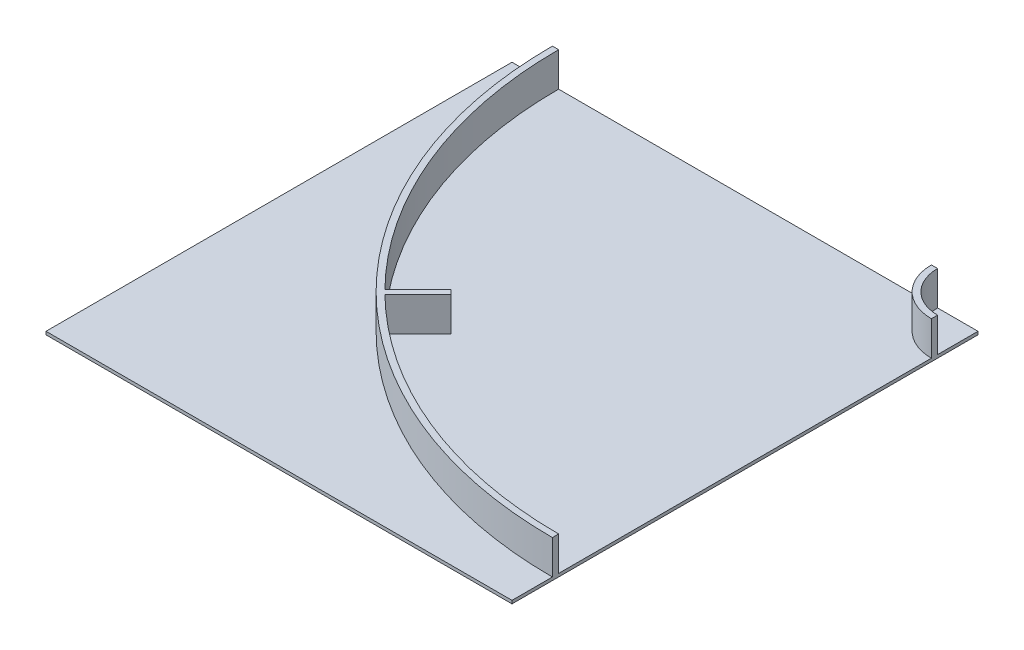
ISO-10303-21;
HEADER;
FILE_DESCRIPTION(('STEP AP214'),'2;1');
FILE_NAME('part.step','',(''),(''),'','','');
FILE_SCHEMA(('AUTOMOTIVE_DESIGN { 1 0 10303 214 1 1 1 1 }'));
ENDSEC;
DATA;
#1=APPLICATION_CONTEXT('core data for automotive mechanical design processes');
#2=APPLICATION_PROTOCOL_DEFINITION('international standard','automotive_design',2000,#1);
#3=PRODUCT_CONTEXT('',#1,'mechanical');
#4=PRODUCT('Part','Part','',(#3));
#5=PRODUCT_RELATED_PRODUCT_CATEGORY('part','',(#4));
#6=PRODUCT_DEFINITION_FORMATION('','',#4);
#7=PRODUCT_DEFINITION_CONTEXT('part definition',#1,'design');
#8=PRODUCT_DEFINITION('design','',#6,#7);
#9=PRODUCT_DEFINITION_SHAPE('','',#8);
#10=(LENGTH_UNIT() NAMED_UNIT(*) SI_UNIT(.MILLI.,.METRE.));
#11=(NAMED_UNIT(*) PLANE_ANGLE_UNIT() SI_UNIT($,.RADIAN.));
#12=(NAMED_UNIT(*) SI_UNIT($,.STERADIAN.) SOLID_ANGLE_UNIT());
#13=UNCERTAINTY_MEASURE_WITH_UNIT(LENGTH_MEASURE(1.E-05),#10,'distance_accuracy_value','');
#14=(GEOMETRIC_REPRESENTATION_CONTEXT(3) GLOBAL_UNCERTAINTY_ASSIGNED_CONTEXT((#13)) GLOBAL_UNIT_ASSIGNED_CONTEXT((#10,
#11,#12)) REPRESENTATION_CONTEXT('',''));
#15=CARTESIAN_POINT('',(0.,0.,0.));
#16=DIRECTION('',(0.,0.,1.));
#17=DIRECTION('',(1.,0.,0.));
#18=AXIS2_PLACEMENT_3D('',#15,#16,#17);
#19=CARTESIAN_POINT('',(0.,10.,0.));
#20=DIRECTION('',(0.,1.,0.));
#21=DIRECTION('',(0.,0.,1.));
#22=AXIS2_PLACEMENT_3D('',#19,#20,#21);
#23=PLANE('',#22);
#24=DIRECTION('',(-0.707106781186547,0.,-0.707106781186547));
#25=VECTOR('',#24,1.);
#26=CARTESIAN_POINT('',(-91.4570696119912,10.,105.599205235722));
#27=LINE('',#26,#25);
#28=CARTESIAN_POINT('',(-91.4570696119912,10.,105.599205235722));
#29=VERTEX_POINT('',#28);
#30=CARTESIAN_POINT('',(-105.599205235722,10.,91.4570696119911));
#31=VERTEX_POINT('',#30);
#32=EDGE_CURVE('E80',#29,#31,#27,.T.);
#33=ORIENTED_EDGE('',*,*,#32,.F.);
#34=DIRECTION('',(0.707106781186548,0.,-0.707106781186548));
#35=VECTOR('',#34,1.);
#36=CARTESIAN_POINT('',(-197.523086789973,10.,211.665222413704));
#37=LINE('',#36,#35);
#38=CARTESIAN_POINT('',(-197.496897290672,10.,211.639032914403));
#39=VERTEX_POINT('',#38);
#40=EDGE_CURVE('E202',#39,#29,#37,.T.);
#41=ORIENTED_EDGE('',*,*,#40,.F.);
#42=CARTESIAN_POINT('',(750.,10.,-750.));
#43=DIRECTION('',(0.,1.,0.));
#44=DIRECTION('',(0.,0.,1.));
#45=AXIS2_PLACEMENT_3D('',#42,#43,#44);
#46=CIRCLE('',#45,1350.);
#47=CARTESIAN_POINT('',(750.,10.,599.999999999999));
#48=VERTEX_POINT('',#47);
#49=EDGE_CURVE('E66',#39,#48,#46,.T.);
#50=ORIENTED_EDGE('',*,*,#49,.T.);
#51=DIRECTION('',(0.,0.,-1.));
#52=VECTOR('',#51,1.);
#53=CARTESIAN_POINT('',(750.,10.,-750.));
#54=LINE('',#53,#52);
#55=CARTESIAN_POINT('',(750.,10.,-600.));
#56=VERTEX_POINT('',#55);
#57=EDGE_CURVE('E291',#48,#56,#54,.T.);
#58=ORIENTED_EDGE('',*,*,#57,.T.);
#59=CARTESIAN_POINT('',(750.,10.,-750.));
#60=DIRECTION('',(0.,1.,0.));
#61=DIRECTION('',(0.,0.,1.));
#62=AXIS2_PLACEMENT_3D('',#59,#60,#61);
#63=CIRCLE('',#62,150.);
#64=CARTESIAN_POINT('',(600.,10.,-750.));
#65=VERTEX_POINT('',#64);
#66=EDGE_CURVE('E214',#65,#56,#63,.T.);
#67=ORIENTED_EDGE('',*,*,#66,.F.);
#68=DIRECTION('',(-1.,0.,0.));
#69=VECTOR('',#68,1.);
#70=CARTESIAN_POINT('',(-750.,10.,-750.));
#71=LINE('',#70,#69);
#72=CARTESIAN_POINT('',(-600.,10.,-750.));
#73=VERTEX_POINT('',#72);
#74=EDGE_CURVE('E280',#65,#73,#71,.T.);
#75=ORIENTED_EDGE('',*,*,#74,.T.);
#76=CARTESIAN_POINT('',(-211.639032914403,10.,197.496897290672));
#77=VERTEX_POINT('',#76);
#78=EDGE_CURVE('E240',#73,#77,#46,.T.);
#79=ORIENTED_EDGE('',*,*,#78,.T.);
#80=DIRECTION('',(-0.707106781186548,0.,0.707106781186548));
#81=VECTOR('',#80,1.);
#82=CARTESIAN_POINT('',(-211.665222413704,10.,197.523086789973));
#83=LINE('',#82,#81);
#84=EDGE_CURVE('E85',#31,#77,#83,.T.);
#85=ORIENTED_EDGE('',*,*,#84,.F.);
#86=EDGE_LOOP('',(#33,#41,#50,#58,#67,#75,#79,#85));
#87=FACE_BOUND('',#86,.T.);
#88=ADVANCED_FACE('F62',(#87),#23,.T.);
#89=CARTESIAN_POINT('',(750.,120.,-750.));
#90=DIRECTION('',(0.,-1.,0.));
#91=DIRECTION('',(0.,0.,-1.));
#92=AXIS2_PLACEMENT_3D('',#89,#90,#91);
#93=CYLINDRICAL_SURFACE('',#92,1350.);
#94=ORIENTED_EDGE('',*,*,#49,.F.);
#95=DIRECTION('',(0.,-1.,0.));
#96=VECTOR('',#95,1.);
#97=CARTESIAN_POINT('',(-197.496897290672,120.,211.639032914403));
#98=LINE('',#97,#96);
#99=CARTESIAN_POINT('',(-197.496897290672,120.,211.639032914403));
#100=VERTEX_POINT('',#99);
#101=EDGE_CURVE('E198',#39,#100,#98,.F.);
#102=ORIENTED_EDGE('',*,*,#101,.T.);
#103=CARTESIAN_POINT('',(750.,120.,-750.));
#104=DIRECTION('',(0.,1.,0.));
#105=DIRECTION('',(0.,0.,1.));
#106=AXIS2_PLACEMENT_3D('',#103,#104,#105);
#107=CIRCLE('',#106,1350.);
#108=CARTESIAN_POINT('',(750.,120.,599.999999999999));
#109=VERTEX_POINT('',#108);
#110=EDGE_CURVE('E245',#100,#109,#107,.T.);
#111=ORIENTED_EDGE('',*,*,#110,.T.);
#112=DIRECTION('',(0.,-1.,0.));
#113=VECTOR('',#112,1.);
#114=CARTESIAN_POINT('',(750.,120.,599.999999999999));
#115=LINE('',#114,#113);
#116=EDGE_CURVE('E263',#109,#48,#115,.T.);
#117=ORIENTED_EDGE('',*,*,#116,.T.);
#118=EDGE_LOOP('',(#94,#102,#111,#117));
#119=FACE_BOUND('',#118,.T.);
#120=ADVANCED_FACE('F362',(#119),#93,.F.);
#121=CARTESIAN_POINT('',(-600.,120.,-750.));
#122=VERTEX_POINT('',#121);
#123=CARTESIAN_POINT('',(-211.639032914403,120.,197.496897290672));
#124=VERTEX_POINT('',#123);
#125=EDGE_CURVE('E246',#122,#124,#107,.T.);
#126=ORIENTED_EDGE('',*,*,#125,.T.);
#127=DIRECTION('',(0.,-1.,0.));
#128=VECTOR('',#127,1.);
#129=CARTESIAN_POINT('',(-211.639032914403,120.,197.496897290672));
#130=LINE('',#129,#128);
#131=EDGE_CURVE('E190',#124,#77,#130,.T.);
#132=ORIENTED_EDGE('',*,*,#131,.T.);
#133=ORIENTED_EDGE('',*,*,#78,.F.);
#134=DIRECTION('',(0.,-1.,0.));
#135=VECTOR('',#134,1.);
#136=CARTESIAN_POINT('',(-600.,120.,-750.));
#137=LINE('',#136,#135);
#138=EDGE_CURVE('E248',#122,#73,#137,.T.);
#139=ORIENTED_EDGE('',*,*,#138,.F.);
#140=EDGE_LOOP('',(#126,#132,#133,#139));
#141=FACE_BOUND('',#140,.T.);
#142=ADVANCED_FACE('F365',(#141),#93,.F.);
#143=CARTESIAN_POINT('',(750.,10.,-750.));
#144=DIRECTION('',(0.,1.,0.));
#145=DIRECTION('',(0.,0.,1.));
#146=AXIS2_PLACEMENT_3D('',#143,#144,#145);
#147=CIRCLE('',#146,130.);
#148=CARTESIAN_POINT('',(620.,10.,-750.));
#149=VERTEX_POINT('',#148);
#150=CARTESIAN_POINT('',(750.,10.,-620.));
#151=VERTEX_POINT('',#150);
#152=EDGE_CURVE('E209',#149,#151,#147,.T.);
#153=ORIENTED_EDGE('',*,*,#152,.T.);
#154=CARTESIAN_POINT('',(750.,10.,-750.));
#155=VERTEX_POINT('',#154);
#156=EDGE_CURVE('E282',#151,#155,#54,.T.);
#157=ORIENTED_EDGE('',*,*,#156,.T.);
#158=EDGE_CURVE('E281',#155,#149,#71,.T.);
#159=ORIENTED_EDGE('',*,*,#158,.T.);
#160=EDGE_LOOP('',(#153,#157,#159));
#161=FACE_BOUND('',#160,.T.);
#162=ADVANCED_FACE('F345',(#161),#23,.T.);
#163=CARTESIAN_POINT('',(750.,10.,-750.));
#164=DIRECTION('',(-1.,0.,0.));
#165=DIRECTION('',(0.,0.,1.));
#166=AXIS2_PLACEMENT_3D('',#163,#164,#165);
#167=PLANE('',#166);
#168=DIRECTION('',(0.,0.,-1.));
#169=VECTOR('',#168,1.);
#170=CARTESIAN_POINT('',(750.,0.,-750.));
#171=LINE('',#170,#169);
#172=CARTESIAN_POINT('',(750.,0.,750.));
#173=VERTEX_POINT('',#172);
#174=CARTESIAN_POINT('',(750.,0.,-750.));
#175=VERTEX_POINT('',#174);
#176=EDGE_CURVE('E268',#173,#175,#171,.T.);
#177=ORIENTED_EDGE('',*,*,#176,.T.);
#178=DIRECTION('',(0.,-1.,0.));
#179=VECTOR('',#178,1.);
#180=CARTESIAN_POINT('',(750.,10.,-750.));
#181=LINE('',#180,#179);
#182=EDGE_CURVE('E12',#155,#175,#181,.T.);
#183=ORIENTED_EDGE('',*,*,#182,.F.);
#184=ORIENTED_EDGE('',*,*,#156,.F.);
#185=DIRECTION('',(0.,-1.,0.));
#186=VECTOR('',#185,1.);
#187=CARTESIAN_POINT('',(750.,120.,-620.));
#188=LINE('',#187,#186);
#189=CARTESIAN_POINT('',(750.,120.,-620.));
#190=VERTEX_POINT('',#189);
#191=EDGE_CURVE('E220',#190,#151,#188,.T.);
#192=ORIENTED_EDGE('',*,*,#191,.F.);
#193=DIRECTION('',(0.,0.,-1.));
#194=VECTOR('',#193,1.);
#195=CARTESIAN_POINT('',(750.,120.,-1.11022302462516E-13));
#196=LINE('',#195,#194);
#197=CARTESIAN_POINT('',(750.,120.,-600.));
#198=VERTEX_POINT('',#197);
#199=EDGE_CURVE('E218',#198,#190,#196,.T.);
#200=ORIENTED_EDGE('',*,*,#199,.F.);
#201=DIRECTION('',(0.,-1.,0.));
#202=VECTOR('',#201,1.);
#203=CARTESIAN_POINT('',(750.,120.,-600.));
#204=LINE('',#203,#202);
#205=EDGE_CURVE('E226',#198,#56,#204,.T.);
#206=ORIENTED_EDGE('',*,*,#205,.T.);
#207=ORIENTED_EDGE('',*,*,#57,.F.);
#208=ORIENTED_EDGE('',*,*,#116,.F.);
#209=DIRECTION('',(0.,0.,-1.));
#210=VECTOR('',#209,1.);
#211=CARTESIAN_POINT('',(750.,120.,-1.11022302462516E-13));
#212=LINE('',#211,#210);
#213=CARTESIAN_POINT('',(750.,120.,620.));
#214=VERTEX_POINT('',#213);
#215=EDGE_CURVE('E242',#214,#109,#212,.T.);
#216=ORIENTED_EDGE('',*,*,#215,.F.);
#217=DIRECTION('',(0.,-1.,0.));
#218=VECTOR('',#217,1.);
#219=CARTESIAN_POINT('',(750.,120.,620.));
#220=LINE('',#219,#218);
#221=CARTESIAN_POINT('',(750.,10.,620.));
#222=VERTEX_POINT('',#221);
#223=EDGE_CURVE('E259',#214,#222,#220,.T.);
#224=ORIENTED_EDGE('',*,*,#223,.T.);
#225=CARTESIAN_POINT('',(750.,10.,750.));
#226=VERTEX_POINT('',#225);
#227=EDGE_CURVE('E293',#226,#222,#54,.T.);
#228=ORIENTED_EDGE('',*,*,#227,.F.);
#229=DIRECTION('',(0.,-1.,0.));
#230=VECTOR('',#229,1.);
#231=CARTESIAN_POINT('',(750.,10.,750.));
#232=LINE('',#231,#230);
#233=EDGE_CURVE('E300',#226,#173,#232,.T.);
#234=ORIENTED_EDGE('',*,*,#233,.T.);
#235=EDGE_LOOP('',(#177,#183,#184,#192,#200,#206,#207,#208,#216,#224,#228,#234));
#236=FACE_BOUND('',#235,.T.);
#237=ADVANCED_FACE('F64',(#236),#167,.F.);
#238=CARTESIAN_POINT('',(-750.,10.,-750.));
#239=DIRECTION('',(0.,0.,1.));
#240=DIRECTION('',(1.,0.,0.));
#241=AXIS2_PLACEMENT_3D('',#238,#239,#240);
#242=PLANE('',#241);
#243=DIRECTION('',(-1.,0.,0.));
#244=VECTOR('',#243,1.);
#245=CARTESIAN_POINT('',(-750.,0.,-750.));
#246=LINE('',#245,#244);
#247=CARTESIAN_POINT('',(-750.,0.,-750.));
#248=VERTEX_POINT('',#247);
#249=EDGE_CURVE('E308',#175,#248,#246,.T.);
#250=ORIENTED_EDGE('',*,*,#249,.T.);
#251=DIRECTION('',(0.,-1.,0.));
#252=VECTOR('',#251,1.);
#253=CARTESIAN_POINT('',(-750.,10.,-750.));
#254=LINE('',#253,#252);
#255=CARTESIAN_POINT('',(-750.,10.,-750.));
#256=VERTEX_POINT('',#255);
#257=EDGE_CURVE('E72',#256,#248,#254,.T.);
#258=ORIENTED_EDGE('',*,*,#257,.F.);
#259=CARTESIAN_POINT('',(-620.,10.,-750.));
#260=VERTEX_POINT('',#259);
#261=EDGE_CURVE('E256',#260,#256,#71,.T.);
#262=ORIENTED_EDGE('',*,*,#261,.F.);
#263=DIRECTION('',(0.,-1.,0.));
#264=VECTOR('',#263,1.);
#265=CARTESIAN_POINT('',(-620.,120.,-750.));
#266=LINE('',#265,#264);
#267=CARTESIAN_POINT('',(-620.,120.,-750.));
#268=VERTEX_POINT('',#267);
#269=EDGE_CURVE('E262',#268,#260,#266,.T.);
#270=ORIENTED_EDGE('',*,*,#269,.F.);
#271=DIRECTION('',(-1.,0.,0.));
#272=VECTOR('',#271,1.);
#273=CARTESIAN_POINT('',(0.,120.,-750.));
#274=LINE('',#273,#272);
#275=EDGE_CURVE('E236',#122,#268,#274,.T.);
#276=ORIENTED_EDGE('',*,*,#275,.F.);
#277=ORIENTED_EDGE('',*,*,#138,.T.);
#278=ORIENTED_EDGE('',*,*,#74,.F.);
#279=DIRECTION('',(0.,-1.,0.));
#280=VECTOR('',#279,1.);
#281=CARTESIAN_POINT('',(600.,120.,-750.));
#282=LINE('',#281,#280);
#283=CARTESIAN_POINT('',(600.,120.,-750.));
#284=VERTEX_POINT('',#283);
#285=EDGE_CURVE('E229',#284,#65,#282,.T.);
#286=ORIENTED_EDGE('',*,*,#285,.F.);
#287=DIRECTION('',(-1.,0.,0.));
#288=VECTOR('',#287,1.);
#289=CARTESIAN_POINT('',(0.,120.,-750.));
#290=LINE('',#289,#288);
#291=CARTESIAN_POINT('',(620.,120.,-750.));
#292=VERTEX_POINT('',#291);
#293=EDGE_CURVE('E213',#292,#284,#290,.T.);
#294=ORIENTED_EDGE('',*,*,#293,.F.);
#295=DIRECTION('',(0.,-1.,0.));
#296=VECTOR('',#295,1.);
#297=CARTESIAN_POINT('',(620.,120.,-750.));
#298=LINE('',#297,#296);
#299=EDGE_CURVE('E232',#292,#149,#298,.T.);
#300=ORIENTED_EDGE('',*,*,#299,.T.);
#301=ORIENTED_EDGE('',*,*,#158,.F.);
#302=ORIENTED_EDGE('',*,*,#182,.T.);
#303=EDGE_LOOP('',(#250,#258,#262,#270,#276,#277,#278,#286,#294,#300,#301,#302));
#304=FACE_BOUND('',#303,.T.);
#305=ADVANCED_FACE('F335',(#304),#242,.F.);
#306=CARTESIAN_POINT('',(-750.,10.,-750.));
#307=DIRECTION('',(1.,0.,0.));
#308=DIRECTION('',(0.,0.,-1.));
#309=AXIS2_PLACEMENT_3D('',#306,#307,#308);
#310=PLANE('',#309);
#311=DIRECTION('',(0.,0.,1.));
#312=VECTOR('',#311,1.);
#313=CARTESIAN_POINT('',(-750.,0.,-750.));
#314=LINE('',#313,#312);
#315=CARTESIAN_POINT('',(-750.,0.,750.));
#316=VERTEX_POINT('',#315);
#317=EDGE_CURVE('E306',#248,#316,#314,.T.);
#318=ORIENTED_EDGE('',*,*,#317,.T.);
#319=DIRECTION('',(0.,-1.,0.));
#320=VECTOR('',#319,1.);
#321=CARTESIAN_POINT('',(-750.,10.,750.));
#322=LINE('',#321,#320);
#323=CARTESIAN_POINT('',(-750.,10.,750.));
#324=VERTEX_POINT('',#323);
#325=EDGE_CURVE('E297',#324,#316,#322,.T.);
#326=ORIENTED_EDGE('',*,*,#325,.F.);
#327=DIRECTION('',(0.,0.,1.));
#328=VECTOR('',#327,1.);
#329=CARTESIAN_POINT('',(-750.,10.,-750.));
#330=LINE('',#329,#328);
#331=EDGE_CURVE('E286',#256,#324,#330,.T.);
#332=ORIENTED_EDGE('',*,*,#331,.F.);
#333=ORIENTED_EDGE('',*,*,#257,.T.);
#334=EDGE_LOOP('',(#318,#326,#332,#333));
#335=FACE_BOUND('',#334,.T.);
#336=ADVANCED_FACE('F320',(#335),#310,.F.);
#337=CARTESIAN_POINT('',(-750.,10.,750.));
#338=DIRECTION('',(0.,0.,-1.));
#339=DIRECTION('',(-1.,0.,0.));
#340=AXIS2_PLACEMENT_3D('',#337,#338,#339);
#341=PLANE('',#340);
#342=DIRECTION('',(1.,0.,0.));
#343=VECTOR('',#342,1.);
#344=CARTESIAN_POINT('',(-750.,0.,750.));
#345=LINE('',#344,#343);
#346=EDGE_CURVE('E304',#316,#173,#345,.T.);
#347=ORIENTED_EDGE('',*,*,#346,.T.);
#348=ORIENTED_EDGE('',*,*,#233,.F.);
#349=DIRECTION('',(1.,0.,0.));
#350=VECTOR('',#349,1.);
#351=CARTESIAN_POINT('',(-750.,10.,750.));
#352=LINE('',#351,#350);
#353=EDGE_CURVE('E303',#324,#226,#352,.T.);
#354=ORIENTED_EDGE('',*,*,#353,.F.);
#355=ORIENTED_EDGE('',*,*,#325,.T.);
#356=EDGE_LOOP('',(#347,#348,#354,#355));
#357=FACE_BOUND('',#356,.T.);
#358=ADVANCED_FACE('F324',(#357),#341,.F.);
#359=CARTESIAN_POINT('',(750.,10.,-750.));
#360=DIRECTION('',(0.,1.,0.));
#361=DIRECTION('',(0.,0.,1.));
#362=AXIS2_PLACEMENT_3D('',#359,#360,#361);
#363=CIRCLE('',#362,1370.);
#364=EDGE_CURVE('E235',#260,#222,#363,.T.);
#365=ORIENTED_EDGE('',*,*,#364,.F.);
#366=ORIENTED_EDGE('',*,*,#261,.T.);
#367=ORIENTED_EDGE('',*,*,#331,.T.);
#368=ORIENTED_EDGE('',*,*,#353,.T.);
#369=ORIENTED_EDGE('',*,*,#227,.T.);
#370=EDGE_LOOP('',(#365,#366,#367,#368,#369));
#371=FACE_BOUND('',#370,.T.);
#372=ADVANCED_FACE('F316',(#371),#23,.T.);
#373=CARTESIAN_POINT('',(0.,0.,0.));
#374=DIRECTION('',(0.,1.,0.));
#375=DIRECTION('',(0.,0.,1.));
#376=AXIS2_PLACEMENT_3D('',#373,#374,#375);
#377=PLANE('',#376);
#378=ORIENTED_EDGE('',*,*,#176,.F.);
#379=ORIENTED_EDGE('',*,*,#346,.F.);
#380=ORIENTED_EDGE('',*,*,#317,.F.);
#381=ORIENTED_EDGE('',*,*,#249,.F.);
#382=EDGE_LOOP('',(#378,#379,#380,#381));
#383=FACE_BOUND('',#382,.T.);
#384=ADVANCED_FACE('F337',(#383),#377,.F.);
#385=CARTESIAN_POINT('',(750.,120.,-750.));
#386=DIRECTION('',(0.,-1.,0.));
#387=DIRECTION('',(0.,0.,-1.));
#388=AXIS2_PLACEMENT_3D('',#385,#386,#387);
#389=CYLINDRICAL_SURFACE('',#388,1370.);
#390=ORIENTED_EDGE('',*,*,#364,.T.);
#391=ORIENTED_EDGE('',*,*,#223,.F.);
#392=CARTESIAN_POINT('',(750.,120.,-750.));
#393=DIRECTION('',(0.,1.,0.));
#394=DIRECTION('',(0.,0.,1.));
#395=AXIS2_PLACEMENT_3D('',#392,#393,#394);
#396=CIRCLE('',#395,1370.);
#397=EDGE_CURVE('E239',#268,#214,#396,.T.);
#398=ORIENTED_EDGE('',*,*,#397,.F.);
#399=ORIENTED_EDGE('',*,*,#269,.T.);
#400=EDGE_LOOP('',(#390,#391,#398,#399));
#401=FACE_BOUND('',#400,.T.);
#402=ADVANCED_FACE('F331',(#401),#389,.T.);
#403=CARTESIAN_POINT('',(0.,120.,0.));
#404=DIRECTION('',(0.,1.,0.));
#405=DIRECTION('',(0.,0.,1.));
#406=AXIS2_PLACEMENT_3D('',#403,#404,#405);
#407=PLANE('',#406);
#408=ORIENTED_EDGE('',*,*,#110,.F.);
#409=DIRECTION('',(0.707106781186548,0.,-0.707106781186548));
#410=VECTOR('',#409,1.);
#411=CARTESIAN_POINT('',(-197.523086789973,120.,211.665222413704));
#412=LINE('',#411,#410);
#413=CARTESIAN_POINT('',(-91.4570696119912,120.,105.599205235722));
#414=VERTEX_POINT('',#413);
#415=EDGE_CURVE('E193',#100,#414,#412,.T.);
#416=ORIENTED_EDGE('',*,*,#415,.T.);
#417=DIRECTION('',(-0.707106781186548,0.,-0.707106781186548));
#418=VECTOR('',#417,1.);
#419=CARTESIAN_POINT('',(-91.4570696119912,120.,105.599205235722));
#420=LINE('',#419,#418);
#421=CARTESIAN_POINT('',(-105.599205235722,120.,91.4570696119911));
#422=VERTEX_POINT('',#421);
#423=EDGE_CURVE('E182',#414,#422,#420,.T.);
#424=ORIENTED_EDGE('',*,*,#423,.T.);
#425=DIRECTION('',(-0.707106781186548,0.,0.707106781186548));
#426=VECTOR('',#425,1.);
#427=CARTESIAN_POINT('',(-211.665222413704,120.,197.523086789973));
#428=LINE('',#427,#426);
#429=EDGE_CURVE('E188',#422,#124,#428,.T.);
#430=ORIENTED_EDGE('',*,*,#429,.T.);
#431=ORIENTED_EDGE('',*,*,#125,.F.);
#432=ORIENTED_EDGE('',*,*,#275,.T.);
#433=ORIENTED_EDGE('',*,*,#397,.T.);
#434=ORIENTED_EDGE('',*,*,#215,.T.);
#435=EDGE_LOOP('',(#408,#416,#424,#430,#431,#432,#433,#434));
#436=FACE_BOUND('',#435,.T.);
#437=ADVANCED_FACE('F195',(#436),#407,.T.);
#438=CARTESIAN_POINT('',(750.,120.,-750.));
#439=DIRECTION('',(0.,-1.,0.));
#440=DIRECTION('',(0.,0.,-1.));
#441=AXIS2_PLACEMENT_3D('',#438,#439,#440);
#442=CYLINDRICAL_SURFACE('',#441,130.);
#443=ORIENTED_EDGE('',*,*,#152,.F.);
#444=ORIENTED_EDGE('',*,*,#299,.F.);
#445=CARTESIAN_POINT('',(750.,120.,-750.));
#446=DIRECTION('',(0.,1.,0.));
#447=DIRECTION('',(0.,0.,1.));
#448=AXIS2_PLACEMENT_3D('',#445,#446,#447);
#449=CIRCLE('',#448,130.);
#450=EDGE_CURVE('E210',#292,#190,#449,.T.);
#451=ORIENTED_EDGE('',*,*,#450,.T.);
#452=ORIENTED_EDGE('',*,*,#191,.T.);
#453=EDGE_LOOP('',(#443,#444,#451,#452));
#454=FACE_BOUND('',#453,.T.);
#455=ADVANCED_FACE('F347',(#454),#442,.F.);
#456=CARTESIAN_POINT('',(750.,120.,-750.));
#457=DIRECTION('',(0.,-1.,0.));
#458=DIRECTION('',(0.,0.,-1.));
#459=AXIS2_PLACEMENT_3D('',#456,#457,#458);
#460=CYLINDRICAL_SURFACE('',#459,150.);
#461=ORIENTED_EDGE('',*,*,#66,.T.);
#462=ORIENTED_EDGE('',*,*,#205,.F.);
#463=CARTESIAN_POINT('',(750.,120.,-750.));
#464=DIRECTION('',(0.,1.,0.));
#465=DIRECTION('',(0.,0.,1.));
#466=AXIS2_PLACEMENT_3D('',#463,#464,#465);
#467=CIRCLE('',#466,150.);
#468=EDGE_CURVE('E216',#284,#198,#467,.T.);
#469=ORIENTED_EDGE('',*,*,#468,.F.);
#470=ORIENTED_EDGE('',*,*,#285,.T.);
#471=EDGE_LOOP('',(#461,#462,#469,#470));
#472=FACE_BOUND('',#471,.T.);
#473=ADVANCED_FACE('F357',(#472),#460,.T.);
#474=CARTESIAN_POINT('',(0.,120.,0.));
#475=DIRECTION('',(0.,1.,0.));
#476=DIRECTION('',(0.,0.,1.));
#477=AXIS2_PLACEMENT_3D('',#474,#475,#476);
#478=PLANE('',#477);
#479=ORIENTED_EDGE('',*,*,#450,.F.);
#480=ORIENTED_EDGE('',*,*,#293,.T.);
#481=ORIENTED_EDGE('',*,*,#468,.T.);
#482=ORIENTED_EDGE('',*,*,#199,.T.);
#483=EDGE_LOOP('',(#479,#480,#481,#482));
#484=FACE_BOUND('',#483,.T.);
#485=ADVANCED_FACE('F353',(#484),#478,.T.);
#486=CARTESIAN_POINT('',(-197.523086789973,290.,211.665222413704));
#487=DIRECTION('',(-0.707106781186547,0.,-0.707106781186547));
#488=DIRECTION('',(-0.707106781186548,0.,0.707106781186548));
#489=AXIS2_PLACEMENT_3D('',#486,#487,#488);
#490=PLANE('',#489);
#491=ORIENTED_EDGE('',*,*,#101,.F.);
#492=ORIENTED_EDGE('',*,*,#40,.T.);
#493=DIRECTION('',(0.,-1.,0.));
#494=VECTOR('',#493,1.);
#495=CARTESIAN_POINT('',(-91.4570696119912,290.,105.599205235722));
#496=LINE('',#495,#494);
#497=EDGE_CURVE('E205',#414,#29,#496,.T.);
#498=ORIENTED_EDGE('',*,*,#497,.F.);
#499=ORIENTED_EDGE('',*,*,#415,.F.);
#500=EDGE_LOOP('',(#491,#492,#498,#499));
#501=FACE_BOUND('',#500,.T.);
#502=ADVANCED_FACE('F476',(#501),#490,.F.);
#503=CARTESIAN_POINT('',(-91.4570696119912,290.,105.599205235722));
#504=DIRECTION('',(-0.707106781186547,0.,0.707106781186547));
#505=DIRECTION('',(0.707106781186548,0.,0.707106781186548));
#506=AXIS2_PLACEMENT_3D('',#503,#504,#505);
#507=PLANE('',#506);
#508=ORIENTED_EDGE('',*,*,#423,.F.);
#509=ORIENTED_EDGE('',*,*,#497,.T.);
#510=ORIENTED_EDGE('',*,*,#32,.T.);
#511=DIRECTION('',(0.,-1.,0.));
#512=VECTOR('',#511,1.);
#513=CARTESIAN_POINT('',(-105.599205235722,290.,91.4570696119911));
#514=LINE('',#513,#512);
#515=EDGE_CURVE('E177',#422,#31,#514,.T.);
#516=ORIENTED_EDGE('',*,*,#515,.F.);
#517=EDGE_LOOP('',(#508,#509,#510,#516));
#518=FACE_BOUND('',#517,.T.);
#519=ADVANCED_FACE('F179',(#518),#507,.F.);
#520=CARTESIAN_POINT('',(-211.665222413704,290.,197.523086789973));
#521=DIRECTION('',(0.707106781186547,0.,0.707106781186547));
#522=DIRECTION('',(0.707106781186548,0.,-0.707106781186548));
#523=AXIS2_PLACEMENT_3D('',#520,#521,#522);
#524=PLANE('',#523);
#525=ORIENTED_EDGE('',*,*,#131,.F.);
#526=ORIENTED_EDGE('',*,*,#429,.F.);
#527=ORIENTED_EDGE('',*,*,#515,.T.);
#528=ORIENTED_EDGE('',*,*,#84,.T.);
#529=EDGE_LOOP('',(#525,#526,#527,#528));
#530=FACE_BOUND('',#529,.T.);
#531=ADVANCED_FACE('F189',(#530),#524,.F.);
#532=CLOSED_SHELL('',(#88,#120,#142,#162,#237,#305,#336,#358,#372,#384,#402,#437,#455,#473,#485,
#502,#519,#531));
#533=MANIFOLD_SOLID_BREP('B2',#532);
#534=ADVANCED_BREP_SHAPE_REPRESENTATION('',(#18,#533),#14);
#535=SHAPE_DEFINITION_REPRESENTATION(#9,#534);
ENDSEC;
END-ISO-10303-21;
